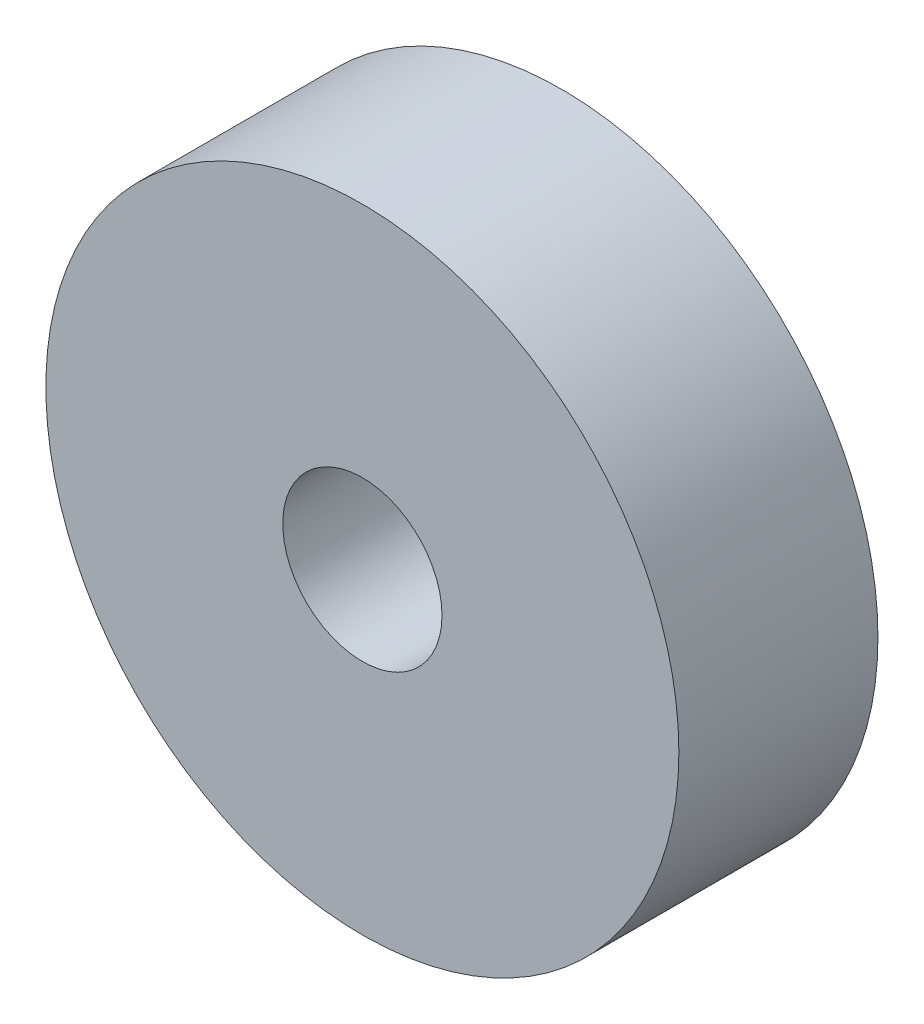
ISO-10303-21;
HEADER;
FILE_DESCRIPTION(('STEP AP214'),'2;1');
FILE_NAME('part.step','',(''),(''),'','','');
FILE_SCHEMA(('AUTOMOTIVE_DESIGN { 1 0 10303 214 1 1 1 1 }'));
ENDSEC;
DATA;
#1=APPLICATION_CONTEXT('core data for automotive mechanical design processes');
#2=APPLICATION_PROTOCOL_DEFINITION('international standard','automotive_design',2000,#1);
#3=PRODUCT_CONTEXT('',#1,'mechanical');
#4=PRODUCT('Part','Part','',(#3));
#5=PRODUCT_RELATED_PRODUCT_CATEGORY('part','',(#4));
#6=PRODUCT_DEFINITION_FORMATION('','',#4);
#7=PRODUCT_DEFINITION_CONTEXT('part definition',#1,'design');
#8=PRODUCT_DEFINITION('design','',#6,#7);
#9=PRODUCT_DEFINITION_SHAPE('','',#8);
#10=(LENGTH_UNIT() NAMED_UNIT(*) SI_UNIT(.MILLI.,.METRE.));
#11=(NAMED_UNIT(*) PLANE_ANGLE_UNIT() SI_UNIT($,.RADIAN.));
#12=(NAMED_UNIT(*) SI_UNIT($,.STERADIAN.) SOLID_ANGLE_UNIT());
#13=UNCERTAINTY_MEASURE_WITH_UNIT(LENGTH_MEASURE(1.E-05),#10,'distance_accuracy_value','');
#14=(GEOMETRIC_REPRESENTATION_CONTEXT(3) GLOBAL_UNCERTAINTY_ASSIGNED_CONTEXT((#13)) GLOBAL_UNIT_ASSIGNED_CONTEXT((#10,
#11,#12)) REPRESENTATION_CONTEXT('',''));
#15=CARTESIAN_POINT('',(0.,0.,0.));
#16=DIRECTION('',(0.,0.,1.));
#17=DIRECTION('',(1.,0.,0.));
#18=AXIS2_PLACEMENT_3D('',#15,#16,#17);
#19=CARTESIAN_POINT('',(37.944866712924,25.3523208670066,10.));
#20=DIRECTION('',(0.,0.,1.));
#21=DIRECTION('',(1.,0.,0.));
#22=AXIS2_PLACEMENT_3D('',#19,#20,#21);
#23=PLANE('',#22);
#24=CARTESIAN_POINT('',(37.944866712924,25.3523208670066,10.));
#25=DIRECTION('',(0.,0.,1.));
#26=DIRECTION('',(1.,0.,0.));
#27=AXIS2_PLACEMENT_3D('',#24,#25,#26);
#28=CIRCLE('',#27,15.9);
#29=CARTESIAN_POINT('',(53.844866712924,25.3523208670066,10.));
#30=VERTEX_POINT('',#29);
#31=EDGE_CURVE('E10',#30,#30,#28,.T.);
#32=ORIENTED_EDGE('',*,*,#31,.T.);
#33=EDGE_LOOP('',(#32));
#34=FACE_BOUND('',#33,.T.);
#35=CARTESIAN_POINT('',(37.944866712924,25.3523208670066,10.));
#36=DIRECTION('',(0.,0.,1.));
#37=DIRECTION('',(1.,0.,0.));
#38=AXIS2_PLACEMENT_3D('',#35,#36,#37);
#39=CIRCLE('',#38,4.);
#40=CARTESIAN_POINT('',(41.944866712924,25.3523208670066,10.));
#41=VERTEX_POINT('',#40);
#42=EDGE_CURVE('E42',#41,#41,#39,.T.);
#43=ORIENTED_EDGE('',*,*,#42,.F.);
#44=EDGE_LOOP('',(#43));
#45=FACE_BOUND('',#44,.T.);
#46=ADVANCED_FACE('F31',(#34,#45),#23,.T.);
#47=CARTESIAN_POINT('',(37.944866712924,25.3523208670066,0.));
#48=DIRECTION('',(0.,0.,1.));
#49=DIRECTION('',(1.,0.,0.));
#50=AXIS2_PLACEMENT_3D('',#47,#48,#49);
#51=PLANE('',#50);
#52=CARTESIAN_POINT('',(37.944866712924,25.3523208670066,0.));
#53=DIRECTION('',(0.,0.,1.));
#54=DIRECTION('',(1.,0.,0.));
#55=AXIS2_PLACEMENT_3D('',#52,#53,#54);
#56=CIRCLE('',#55,15.9);
#57=CARTESIAN_POINT('',(53.844866712924,25.3523208670066,0.));
#58=VERTEX_POINT('',#57);
#59=EDGE_CURVE('E35',#58,#58,#56,.T.);
#60=ORIENTED_EDGE('',*,*,#59,.F.);
#61=EDGE_LOOP('',(#60));
#62=FACE_BOUND('',#61,.T.);
#63=CARTESIAN_POINT('',(37.944866712924,25.3523208670066,0.));
#64=DIRECTION('',(0.,0.,1.));
#65=DIRECTION('',(1.,0.,0.));
#66=AXIS2_PLACEMENT_3D('',#63,#64,#65);
#67=CIRCLE('',#66,4.);
#68=CARTESIAN_POINT('',(41.944866712924,25.3523208670066,0.));
#69=VERTEX_POINT('',#68);
#70=EDGE_CURVE('E44',#69,#69,#67,.T.);
#71=ORIENTED_EDGE('',*,*,#70,.T.);
#72=EDGE_LOOP('',(#71));
#73=FACE_BOUND('',#72,.T.);
#74=ADVANCED_FACE('F54',(#62,#73),#51,.F.);
#75=CARTESIAN_POINT('',(37.944866712924,25.3523208670066,10.));
#76=DIRECTION('',(0.,0.,-1.));
#77=DIRECTION('',(-1.,0.,0.));
#78=AXIS2_PLACEMENT_3D('',#75,#76,#77);
#79=CYLINDRICAL_SURFACE('',#78,15.9);
#80=ORIENTED_EDGE('',*,*,#31,.F.);
#81=EDGE_LOOP('',(#80));
#82=FACE_BOUND('',#81,.T.);
#83=ORIENTED_EDGE('',*,*,#59,.T.);
#84=EDGE_LOOP('',(#83));
#85=FACE_BOUND('',#84,.T.);
#86=ADVANCED_FACE('F33',(#82,#85),#79,.T.);
#87=CARTESIAN_POINT('',(37.944866712924,25.3523208670066,10.));
#88=DIRECTION('',(0.,0.,-1.));
#89=DIRECTION('',(-1.,0.,0.));
#90=AXIS2_PLACEMENT_3D('',#87,#88,#89);
#91=CYLINDRICAL_SURFACE('',#90,4.);
#92=ORIENTED_EDGE('',*,*,#42,.T.);
#93=EDGE_LOOP('',(#92));
#94=FACE_BOUND('',#93,.T.);
#95=ORIENTED_EDGE('',*,*,#70,.F.);
#96=EDGE_LOOP('',(#95));
#97=FACE_BOUND('',#96,.T.);
#98=ADVANCED_FACE('F50',(#94,#97),#91,.F.);
#99=CLOSED_SHELL('',(#46,#74,#86,#98));
#100=MANIFOLD_SOLID_BREP('B2',#99);
#101=ADVANCED_BREP_SHAPE_REPRESENTATION('',(#18,#100),#14);
#102=SHAPE_DEFINITION_REPRESENTATION(#9,#101);
ENDSEC;
END-ISO-10303-21;
